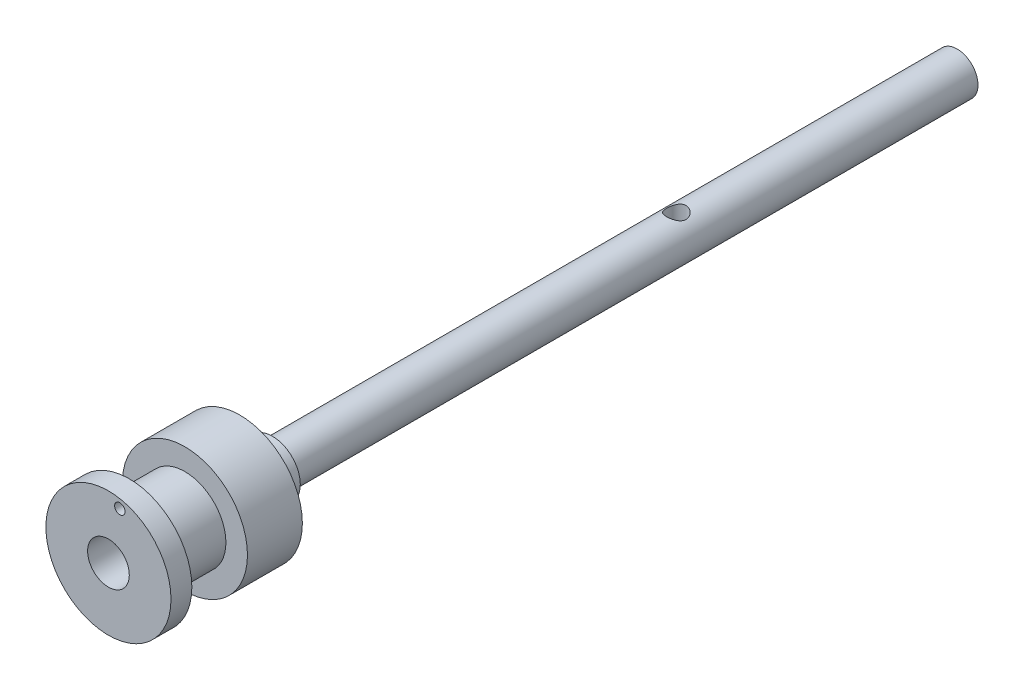
ISO-10303-21;
HEADER;
FILE_DESCRIPTION(('STEP AP214'),'2;1');
FILE_NAME('part.step','',(''),(''),'','','');
FILE_SCHEMA(('AUTOMOTIVE_DESIGN { 1 0 10303 214 1 1 1 1 }'));
ENDSEC;
DATA;
#1=APPLICATION_CONTEXT('core data for automotive mechanical design processes');
#2=APPLICATION_PROTOCOL_DEFINITION('international standard','automotive_design',2000,#1);
#3=PRODUCT_CONTEXT('',#1,'mechanical');
#4=PRODUCT('Part','Part','',(#3));
#5=PRODUCT_RELATED_PRODUCT_CATEGORY('part','',(#4));
#6=PRODUCT_DEFINITION_FORMATION('','',#4);
#7=PRODUCT_DEFINITION_CONTEXT('part definition',#1,'design');
#8=PRODUCT_DEFINITION('design','',#6,#7);
#9=PRODUCT_DEFINITION_SHAPE('','',#8);
#10=(LENGTH_UNIT() NAMED_UNIT(*) SI_UNIT(.MILLI.,.METRE.));
#11=(NAMED_UNIT(*) PLANE_ANGLE_UNIT() SI_UNIT($,.RADIAN.));
#12=(NAMED_UNIT(*) SI_UNIT($,.STERADIAN.) SOLID_ANGLE_UNIT());
#13=UNCERTAINTY_MEASURE_WITH_UNIT(LENGTH_MEASURE(1.E-05),#10,'distance_accuracy_value','');
#14=(GEOMETRIC_REPRESENTATION_CONTEXT(3) GLOBAL_UNCERTAINTY_ASSIGNED_CONTEXT((#13)) GLOBAL_UNIT_ASSIGNED_CONTEXT((#10,
#11,#12)) REPRESENTATION_CONTEXT('',''));
#15=CARTESIAN_POINT('',(0.,0.,0.));
#16=DIRECTION('',(0.,0.,1.));
#17=DIRECTION('',(1.,0.,0.));
#18=AXIS2_PLACEMENT_3D('',#15,#16,#17);
#19=CARTESIAN_POINT('',(0.,0.,98.5));
#20=DIRECTION('',(0.,0.,-1.));
#21=DIRECTION('',(-1.,0.,0.));
#22=AXIS2_PLACEMENT_3D('',#19,#20,#21);
#23=CYLINDRICAL_SURFACE('',#22,3.);
#24=CARTESIAN_POINT('',(0.,-2.99999999999999,39.));
#25=CARTESIAN_POINT('',(0.0741760141958587,-2.99999659855667,39.0000040505541));
#26=CARTESIAN_POINT('',(0.148457438343165,-2.99721866421498,39.0059298208353));
#27=CARTESIAN_POINT('',(0.294860958042646,-2.98638133101227,39.0293877592733));
#28=CARTESIAN_POINT('',(0.366977899485668,-2.97831023303417,39.046945637961));
#29=CARTESIAN_POINT('',(0.506705207958361,-2.95773878056305,39.0928517551339));
#30=CARTESIAN_POINT('',(0.574331184032734,-2.94525483671524,39.1211600432343));
#31=CARTESIAN_POINT('',(0.703790652559765,-2.91703179641225,39.1875743006987));
#32=CARTESIAN_POINT('',(0.765625113804216,-2.90129324579851,39.2256786273952));
#33=CARTESIAN_POINT('',(0.885556018232688,-2.86703510505486,39.3129906836775));
#34=CARTESIAN_POINT('',(0.943262854198603,-2.84841047078529,39.3626918392666));
#35=CARTESIAN_POINT('',(1.04987206669059,-2.81086626705385,39.4707341871541));
#36=CARTESIAN_POINT('',(1.09876864666267,-2.79194651225135,39.5290810220613));
#37=CARTESIAN_POINT('',(1.18954928643586,-2.75454886272565,39.6573436722992));
#38=CARTESIAN_POINT('',(1.23076801131512,-2.73618026181932,39.7277658265075));
#39=CARTESIAN_POINT('',(1.30060459631542,-2.70368671328043,39.8755083341662));
#40=CARTESIAN_POINT('',(1.32923050054668,-2.68955905843085,39.952824245907));
#41=CARTESIAN_POINT('',(1.37136389166293,-2.66831280778357,40.1077086691858));
#42=CARTESIAN_POINT('',(1.38562630954339,-2.66084688805231,40.185022013398));
#43=CARTESIAN_POINT('',(1.40096431780121,-2.65280653141493,40.3412761554687));
#44=CARTESIAN_POINT('',(1.40205018901381,-2.65222672171534,40.4202156363732));
#45=CARTESIAN_POINT('',(1.39156325474428,-2.6577381391041,40.5689521774073));
#46=CARTESIAN_POINT('',(1.381255487101,-2.66316277668237,40.6388686763252));
#47=CARTESIAN_POINT('',(1.35043639237287,-2.67892103840313,40.7758340783928));
#48=CARTESIAN_POINT('',(1.32992244300339,-2.68925592410991,40.8428822397673));
#49=CARTESIAN_POINT('',(1.27887161255287,-2.71390923378543,40.9740721913311));
#50=CARTESIAN_POINT('',(1.24811450695909,-2.7283140240837,41.0381113040015));
#51=CARTESIAN_POINT('',(1.17761205733664,-2.75947702819645,41.1604059963507));
#52=CARTESIAN_POINT('',(1.13786278548149,-2.77623626923161,41.2186590325906));
#53=CARTESIAN_POINT('',(1.04545769592097,-2.81242518177221,41.3343867427587));
#54=CARTESIAN_POINT('',(0.991869135627394,-2.83194722846672,41.3910901886705));
#55=CARTESIAN_POINT('',(0.875809338201011,-2.86996272516677,41.4950011611005));
#56=CARTESIAN_POINT('',(0.813334864133957,-2.88845579691006,41.5422052120085));
#57=CARTESIAN_POINT('',(0.678420066791921,-2.92314231667083,41.6273252580099));
#58=CARTESIAN_POINT('',(0.60570404390302,-2.9392303997136,41.6648505604658));
#59=CARTESIAN_POINT('',(0.454047875045114,-2.9664385628126,41.7268527185111));
#60=CARTESIAN_POINT('',(0.375112098848912,-2.97756209480586,41.7513386428982));
#61=CARTESIAN_POINT('',(0.219630179590069,-2.99289168727817,41.7847753854863));
#62=CARTESIAN_POINT('',(0.143350867486893,-2.99755511855446,41.7947561577534));
#63=CARTESIAN_POINT('',(-0.00993159603062412,-3.00096130674055,41.8020633399195));
#64=CARTESIAN_POINT('',(-0.0869344549310032,-2.99970636153703,41.7993946611306));
#65=CARTESIAN_POINT('',(-0.234138662301146,-2.99169876992405,41.7821402277437));
#66=CARTESIAN_POINT('',(-0.304455247280262,-2.98531143610107,41.768346120726));
#67=CARTESIAN_POINT('',(-0.441661374952198,-2.9681169868393,41.7304147035299));
#68=CARTESIAN_POINT('',(-0.508550515457683,-2.95730935403884,41.7062761826025));
#69=CARTESIAN_POINT('',(-0.63934631057296,-2.93186182190092,41.6476106001117));
#70=CARTESIAN_POINT('',(-0.70309874977937,-2.91711463217098,41.6127878500144));
#71=CARTESIAN_POINT('',(-0.82408133642419,-2.88527461622476,41.534065572947));
#72=CARTESIAN_POINT('',(-0.881308600637795,-2.86818076040266,41.4901620574598));
#73=CARTESIAN_POINT('',(-0.992927203863409,-2.83157928041133,41.3900494219181));
#74=CARTESIAN_POINT('',(-1.04662821994276,-2.81199150907127,41.3330982533047));
#75=CARTESIAN_POINT('',(-1.14397488618524,-2.7738171204936,41.210822052853));
#76=CARTESIAN_POINT('',(-1.18761573536873,-2.7552309844915,41.1454930459361));
#77=CARTESIAN_POINT('',(-1.26487258942864,-2.72065279755534,41.0055462612367));
#78=CARTESIAN_POINT('',(-1.29811762077689,-2.70476441122083,40.9306959670314));
#79=CARTESIAN_POINT('',(-1.35119476914698,-2.67864935946574,40.7754739377038));
#80=CARTESIAN_POINT('',(-1.37104172650418,-2.6684164320798,40.6951084206029));
#81=CARTESIAN_POINT('',(-1.39512361569358,-2.65589863089785,40.5389244522856));
#82=CARTESIAN_POINT('',(-1.40060458275625,-2.65298045006346,40.4633491392689));
#83=CARTESIAN_POINT('',(-1.39928993042138,-2.65367487263324,40.31234617673));
#84=CARTESIAN_POINT('',(-1.39249775922279,-2.65728564169682,40.2369184916911));
#85=CARTESIAN_POINT('',(-1.36795238910771,-2.66999487603889,40.0940999375163));
#86=CARTESIAN_POINT('',(-1.35103435582631,-2.67867409395688,40.0265240407042));
#87=CARTESIAN_POINT('',(-1.30765598987226,-2.70011439829818,39.8952017153972));
#88=CARTESIAN_POINT('',(-1.28119281477062,-2.71287670048705,39.8314564342173));
#89=CARTESIAN_POINT('',(-1.21748406199401,-2.74208602331761,39.7049634549476));
#90=CARTESIAN_POINT('',(-1.17964038065009,-2.75872111955289,39.6425615223786));
#91=CARTESIAN_POINT('',(-1.0949742620724,-2.79340714138716,39.5246101855588));
#92=CARTESIAN_POINT('',(-1.04814763276813,-2.81145872568486,39.4690640006461));
#93=CARTESIAN_POINT('',(-0.941307680520023,-2.84911508911861,39.3606263800043));
#94=CARTESIAN_POINT('',(-0.880442612871026,-2.86869394428718,39.3085607412822));
#95=CARTESIAN_POINT('',(-0.750199086477072,-2.90547332461736,39.2152565671488));
#96=CARTESIAN_POINT('',(-0.680816600685449,-2.92267271652822,39.1740231823952));
#97=CARTESIAN_POINT('',(-0.535611024288782,-2.95272548252542,39.1040125020167));
#98=CARTESIAN_POINT('',(-0.459824309977937,-2.96560157678301,39.0751698583364));
#99=CARTESIAN_POINT('',(-0.303822742627244,-2.98560363061671,39.0309772564507));
#100=CARTESIAN_POINT('',(-0.223621832238211,-2.99274669700571,39.0155871448256));
#101=CARTESIAN_POINT('',(-0.118989792805172,-2.99773444736987,39.0048609854243));
#102=CARTESIAN_POINT('',(-0.095239768891828,-2.99858232619917,39.0030400999808));
#103=CARTESIAN_POINT('',(-0.0476634596251001,-2.99971565466793,39.00060894435));
#104=CARTESIAN_POINT('',(-0.0238371727597248,-3.00000109308638,38.9999986983156));
#105=CARTESIAN_POINT('',(0.,-2.99999999999999,39.));
#106=B_SPLINE_CURVE_WITH_KNOTS('',3,(#24,#25,#26,#27,#28,#29,#30,#31,#32,#33,#34,#35,#36,#37,
#38,#39,#40,#41,#42,#43,#44,#45,#46,#47,#48,#49,#50,#51,#52,#53,#54,#55,#56,#57,#58,#59,#60,#61,
#62,#63,#64,#65,#66,#67,#68,#69,#70,#71,#72,#73,#74,#75,#76,#77,#78,#79,#80,#81,#82,#83,#84,#85,
#86,#87,#88,#89,#90,#91,#92,#93,#94,#95,#96,#97,#98,#99,#100,#101,#102,#103,#104,#105),
.UNSPECIFIED.,.T.,.F.,(4,2,2,2,2,2,2,2,2,2,2,2,2,2,2,2,2,2,2,2,2,2,2,2,2,2,2,2,2,2,2,2,2,2,2,2,
2,2,2,2,4),(0.,0.222430614227103,0.445354516020347,0.6674579744595,0.889524213319485,
1.12374008349084,1.35810949364731,1.60776429290694,1.85725938392491,2.09282314699249,
2.32820310256045,2.53985531348055,2.75156193252274,2.96815060600376,3.18483406988203,
3.42504393482462,3.66534152788205,3.91419776760518,4.16288070273415,4.39285884216799,
4.62274769694935,4.83758576938905,5.05244899415581,5.27389671638204,5.49544191175846,
5.73644174754949,5.97755635787824,6.2264897623231,6.47514698203737,6.70138965858241,
6.92756878101077,7.13725924988262,7.34701221368888,7.57065894835864,7.79441030722339,
8.04061569917069,8.28693794895592,8.53194466707523,8.77621756163928,8.84769634435318,
8.91917655309538),.UNSPECIFIED.);
#107=CARTESIAN_POINT('',(0.,-2.99999999999999,39.));
#108=VERTEX_POINT('',#107);
#109=EDGE_CURVE('E52',#108,#108,#106,.T.);
#110=ORIENTED_EDGE('',*,*,#109,.F.);
#111=EDGE_LOOP('',(#110));
#112=FACE_BOUND('',#111,.T.);
#113=CARTESIAN_POINT('',(0.,0.,98.5));
#114=DIRECTION('',(0.,0.,1.));
#115=DIRECTION('',(1.,0.,0.));
#116=AXIS2_PLACEMENT_3D('',#113,#114,#115);
#117=CIRCLE('',#116,3.);
#118=CARTESIAN_POINT('',(3.,0.,98.5));
#119=VERTEX_POINT('',#118);
#120=EDGE_CURVE('E10',#119,#119,#117,.T.);
#121=ORIENTED_EDGE('',*,*,#120,.F.);
#122=EDGE_LOOP('',(#121));
#123=FACE_BOUND('',#122,.T.);
#124=CARTESIAN_POINT('',(0.,0.,0.));
#125=DIRECTION('',(0.,0.,1.));
#126=DIRECTION('',(1.,0.,0.));
#127=AXIS2_PLACEMENT_3D('',#124,#125,#126);
#128=CIRCLE('',#127,3.);
#129=CARTESIAN_POINT('',(3.,0.,0.));
#130=VERTEX_POINT('',#129);
#131=EDGE_CURVE('E42',#130,#130,#128,.T.);
#132=ORIENTED_EDGE('',*,*,#131,.T.);
#133=EDGE_LOOP('',(#132));
#134=FACE_BOUND('',#133,.T.);
#135=CARTESIAN_POINT('',(0.,3.00000000000001,39.));
#136=CARTESIAN_POINT('',(-0.0741760141958469,2.99999659855672,39.0000040505541));
#137=CARTESIAN_POINT('',(-0.148457438343151,2.99721866421499,39.0059298208353));
#138=CARTESIAN_POINT('',(-0.29486095804263,2.98638133101226,39.0293877592733));
#139=CARTESIAN_POINT('',(-0.366977899485652,2.97831023303417,39.046945637961));
#140=CARTESIAN_POINT('',(-0.506705207958345,2.95773878056306,39.0928517551339));
#141=CARTESIAN_POINT('',(-0.574331184032717,2.94525483671525,39.1211600432343));
#142=CARTESIAN_POINT('',(-0.703790652559745,2.91703179641225,39.1875743006987));
#143=CARTESIAN_POINT('',(-0.765625113804196,2.90129324579851,39.2256786273952));
#144=CARTESIAN_POINT('',(-0.885556018232667,2.86703510505487,39.3129906836775));
#145=CARTESIAN_POINT('',(-0.943262854198583,2.8484104707853,39.3626918392666));
#146=CARTESIAN_POINT('',(-1.04987206669057,2.81086626705386,39.4707341871541));
#147=CARTESIAN_POINT('',(-1.09876864666265,2.79194651225135,39.5290810220613));
#148=CARTESIAN_POINT('',(-1.18954928643584,2.75454886272566,39.6573436722992));
#149=CARTESIAN_POINT('',(-1.2307680113151,2.73618026181933,39.7277658265075));
#150=CARTESIAN_POINT('',(-1.30060459631541,2.70368671328044,39.8755083341662));
#151=CARTESIAN_POINT('',(-1.32923050054667,2.68955905843086,39.952824245907));
#152=CARTESIAN_POINT('',(-1.37136389166291,2.66831280778357,40.1077086691858));
#153=CARTESIAN_POINT('',(-1.38562630954337,2.66084688805232,40.1850220133979));
#154=CARTESIAN_POINT('',(-1.4009643178012,2.65280653141493,40.3412761554687));
#155=CARTESIAN_POINT('',(-1.4020501890138,2.65222672171534,40.4202156363732));
#156=CARTESIAN_POINT('',(-1.39156325474427,2.6577381391041,40.5689521774073));
#157=CARTESIAN_POINT('',(-1.38125548710099,2.66316277668237,40.6388686763252));
#158=CARTESIAN_POINT('',(-1.35043639237286,2.67892103840314,40.7758340783928));
#159=CARTESIAN_POINT('',(-1.32992244300339,2.68925592410991,40.8428822397673));
#160=CARTESIAN_POINT('',(-1.27887161255287,2.71390923378543,40.9740721913311));
#161=CARTESIAN_POINT('',(-1.24811450695908,2.7283140240837,41.0381113040015));
#162=CARTESIAN_POINT('',(-1.17761205733663,2.75947702819645,41.1604059963507));
#163=CARTESIAN_POINT('',(-1.13786278548148,2.77623626923161,41.2186590325906));
#164=CARTESIAN_POINT('',(-1.04545769592096,2.81242518177222,41.3343867427587));
#165=CARTESIAN_POINT('',(-0.991869135627378,2.83194722846672,41.3910901886705));
#166=CARTESIAN_POINT('',(-0.875809338200995,2.86996272516678,41.4950011611005));
#167=CARTESIAN_POINT('',(-0.81333486413394,2.88845579691007,41.5422052120085));
#168=CARTESIAN_POINT('',(-0.678420066791904,2.92314231667084,41.6273252580099));
#169=CARTESIAN_POINT('',(-0.605704043903002,2.93923039971361,41.6648505604658));
#170=CARTESIAN_POINT('',(-0.454047875045098,2.9664385628126,41.7268527185111));
#171=CARTESIAN_POINT('',(-0.375112098848897,2.97756209480586,41.7513386428982));
#172=CARTESIAN_POINT('',(-0.219630179590056,2.99289168727817,41.7847753854863));
#173=CARTESIAN_POINT('',(-0.143350867486882,2.99755511855446,41.7947561577534));
#174=CARTESIAN_POINT('',(0.00993159603063146,3.00096130674055,41.8020633399195));
#175=CARTESIAN_POINT('',(0.086934454931009,2.99970636153703,41.7993946611306));
#176=CARTESIAN_POINT('',(0.234138662301149,2.99169876992405,41.7821402277437));
#177=CARTESIAN_POINT('',(0.304455247280265,2.98531143610107,41.768346120726));
#178=CARTESIAN_POINT('',(0.4416613749522,2.9681169868393,41.7304147035299));
#179=CARTESIAN_POINT('',(0.508550515457685,2.95730935403884,41.7062761826025));
#180=CARTESIAN_POINT('',(0.63934631057296,2.93186182190092,41.6476106001117));
#181=CARTESIAN_POINT('',(0.703098749779368,2.91711463217098,41.6127878500144));
#182=CARTESIAN_POINT('',(0.824081336424188,2.88527461622476,41.534065572947));
#183=CARTESIAN_POINT('',(0.881308600637792,2.86818076040266,41.4901620574598));
#184=CARTESIAN_POINT('',(0.992927203863407,2.83157928041133,41.3900494219181));
#185=CARTESIAN_POINT('',(1.04662821994276,2.81199150907127,41.3330982533047));
#186=CARTESIAN_POINT('',(1.14397488618524,2.7738171204936,41.2108220528531));
#187=CARTESIAN_POINT('',(1.18761573536872,2.7552309844915,41.1454930459362));
#188=CARTESIAN_POINT('',(1.26487258942863,2.72065279755534,41.0055462612367));
#189=CARTESIAN_POINT('',(1.29811762077689,2.70476441122083,40.9306959670314));
#190=CARTESIAN_POINT('',(1.35119476914698,2.67864935946574,40.7754739377038));
#191=CARTESIAN_POINT('',(1.37104172650419,2.6684164320798,40.695108420603));
#192=CARTESIAN_POINT('',(1.39512361569359,2.65589863089785,40.5389244522856));
#193=CARTESIAN_POINT('',(1.40060458275626,2.65298045006346,40.4633491392689));
#194=CARTESIAN_POINT('',(1.3992899304214,2.65367487263323,40.31234617673));
#195=CARTESIAN_POINT('',(1.3924977592228,2.65728564169681,40.2369184916911));
#196=CARTESIAN_POINT('',(1.36795238910772,2.66999487603889,40.0940999375163));
#197=CARTESIAN_POINT('',(1.35103435582632,2.67867409395687,40.0265240407042));
#198=CARTESIAN_POINT('',(1.30765598987227,2.70011439829818,39.8952017153972));
#199=CARTESIAN_POINT('',(1.28119281477063,2.71287670048704,39.8314564342173));
#200=CARTESIAN_POINT('',(1.21748406199402,2.7420860233176,39.7049634549476));
#201=CARTESIAN_POINT('',(1.1796403806501,2.75872111955289,39.6425615223786));
#202=CARTESIAN_POINT('',(1.09497426207241,2.79340714138716,39.5246101855588));
#203=CARTESIAN_POINT('',(1.04814763276814,2.81145872568485,39.4690640006461));
#204=CARTESIAN_POINT('',(0.941307680520036,2.8491150891186,39.3606263800043));
#205=CARTESIAN_POINT('',(0.880442612871037,2.86869394428718,39.3085607412822));
#206=CARTESIAN_POINT('',(0.750199086477081,2.90547332461736,39.2152565671488));
#207=CARTESIAN_POINT('',(0.680816600685458,2.92267271652822,39.1740231823952));
#208=CARTESIAN_POINT('',(0.53561102428879,2.95272548252542,39.1040125020167));
#209=CARTESIAN_POINT('',(0.459824309977945,2.965601576783,39.0751698583364));
#210=CARTESIAN_POINT('',(0.303822742627252,2.98560363061672,39.0309772564507));
#211=CARTESIAN_POINT('',(0.223621832238217,2.99274669700571,39.0155871448256));
#212=CARTESIAN_POINT('',(0.118989792805178,2.99773444736986,39.0048609854243));
#213=CARTESIAN_POINT('',(0.0952397688918347,2.99858232619917,39.0030400999808));
#214=CARTESIAN_POINT('',(0.0476634596251082,2.99971565466794,39.00060894435));
#215=CARTESIAN_POINT('',(0.0238371727597338,3.0000010930864,38.9999986983156));
#216=CARTESIAN_POINT('',(0.,3.00000000000001,39.));
#217=B_SPLINE_CURVE_WITH_KNOTS('',3,(#135,#136,#137,#138,#139,#140,#141,#142,#143,#144,#145,
#146,#147,#148,#149,#150,#151,#152,#153,#154,#155,#156,#157,#158,#159,#160,#161,#162,#163,#164,
#165,#166,#167,#168,#169,#170,#171,#172,#173,#174,#175,#176,#177,#178,#179,#180,#181,#182,#183,
#184,#185,#186,#187,#188,#189,#190,#191,#192,#193,#194,#195,#196,#197,#198,#199,#200,#201,#202,
#203,#204,#205,#206,#207,#208,#209,#210,#211,#212,#213,#214,#215,#216),.UNSPECIFIED.,.T.,.F.,(4,
2,2,2,2,2,2,2,2,2,2,2,2,2,2,2,2,2,2,2,2,2,2,2,2,2,2,2,2,2,2,2,2,2,2,2,2,2,2,2,4),(0.,
0.222430614227098,0.44535451602034,0.66745797445949,0.889524213319474,1.12374008349083,
1.35810949364729,1.60776429290693,1.85725938392489,2.09282314699247,2.32820310256043,
2.53985531348055,2.75156193252273,2.96815060600376,3.18483406988204,3.42504393482462,
3.66534152788206,3.91419776760519,4.16288070273415,4.39285884216799,4.62274769694934,
4.83758576938904,5.0524489941558,5.27389671638202,5.49544191175844,5.73644174754946,
5.97755635787822,6.22648976232308,6.47514698203736,6.70138965858239,6.92756878101076,
7.13725924988262,7.34701221368887,7.57065894835864,7.79441030722338,8.04061569917069,
8.28693794895592,8.53194466707523,8.77621756163929,8.84769634435318,8.91917655309538),.UNSPECIFIED.);
#218=CARTESIAN_POINT('',(0.,3.00000000000001,39.));
#219=VERTEX_POINT('',#218);
#220=EDGE_CURVE('E35',#219,#219,#217,.T.);
#221=ORIENTED_EDGE('',*,*,#220,.F.);
#222=EDGE_LOOP('',(#221));
#223=FACE_BOUND('',#222,.T.);
#224=ADVANCED_FACE('F31',(#112,#123,#134,#223),#23,.T.);
#225=CARTESIAN_POINT('',(0.,0.,111.1));
#226=DIRECTION('',(0.,0.,1.));
#227=DIRECTION('',(1.,0.,0.));
#228=AXIS2_PLACEMENT_3D('',#225,#226,#227);
#229=PLANE('',#228);
#230=CARTESIAN_POINT('',(0.,0.,111.1));
#231=DIRECTION('',(0.,0.,1.));
#232=DIRECTION('',(1.,0.,0.));
#233=AXIS2_PLACEMENT_3D('',#230,#231,#232);
#234=CIRCLE('',#233,9.);
#235=CARTESIAN_POINT('',(9.,0.,111.1));
#236=VERTEX_POINT('',#235);
#237=EDGE_CURVE('E135',#236,#236,#234,.T.);
#238=ORIENTED_EDGE('',*,*,#237,.T.);
#239=EDGE_LOOP('',(#238));
#240=FACE_BOUND('',#239,.T.);
#241=CARTESIAN_POINT('',(0.,0.,111.1));
#242=DIRECTION('',(0.,0.,1.));
#243=DIRECTION('',(1.,0.,0.));
#244=AXIS2_PLACEMENT_3D('',#241,#242,#243);
#245=CIRCLE('',#244,5.9);
#246=CARTESIAN_POINT('',(5.9,0.,111.1));
#247=VERTEX_POINT('',#246);
#248=EDGE_CURVE('E125',#247,#247,#245,.T.);
#249=ORIENTED_EDGE('',*,*,#248,.F.);
#250=EDGE_LOOP('',(#249));
#251=FACE_BOUND('',#250,.T.);
#252=ADVANCED_FACE('F83',(#240,#251),#229,.T.);
#253=CARTESIAN_POINT('',(0.,0.,0.));
#254=DIRECTION('',(0.,0.,1.));
#255=DIRECTION('',(1.,0.,0.));
#256=AXIS2_PLACEMENT_3D('',#253,#254,#255);
#257=PLANE('',#256);
#258=ORIENTED_EDGE('',*,*,#131,.F.);
#259=EDGE_LOOP('',(#258));
#260=FACE_BOUND('',#259,.T.);
#261=ADVANCED_FACE('F86',(#260),#257,.F.);
#262=CARTESIAN_POINT('',(0.,0.,98.5));
#263=DIRECTION('',(0.,0.,1.));
#264=DIRECTION('',(1.,0.,0.));
#265=AXIS2_PLACEMENT_3D('',#262,#263,#264);
#266=PLANE('',#265);
#267=CARTESIAN_POINT('',(0.,0.,98.5));
#268=DIRECTION('',(0.,0.,1.));
#269=DIRECTION('',(1.,0.,0.));
#270=AXIS2_PLACEMENT_3D('',#267,#268,#269);
#271=CIRCLE('',#270,4.);
#272=CARTESIAN_POINT('',(4.,0.,98.5));
#273=VERTEX_POINT('',#272);
#274=EDGE_CURVE('E50',#273,#273,#271,.T.);
#275=ORIENTED_EDGE('',*,*,#274,.F.);
#276=EDGE_LOOP('',(#275));
#277=FACE_BOUND('',#276,.T.);
#278=ORIENTED_EDGE('',*,*,#120,.T.);
#279=EDGE_LOOP('',(#278));
#280=FACE_BOUND('',#279,.T.);
#281=ADVANCED_FACE('F96',(#277,#280),#266,.F.);
#282=CARTESIAN_POINT('',(0.,0.,103.2));
#283=DIRECTION('',(0.,0.,-1.));
#284=DIRECTION('',(-1.,0.,0.));
#285=AXIS2_PLACEMENT_3D('',#282,#283,#284);
#286=CYLINDRICAL_SURFACE('',#285,4.);
#287=CARTESIAN_POINT('',(0.,0.,103.2));
#288=DIRECTION('',(0.,0.,1.));
#289=DIRECTION('',(1.,0.,0.));
#290=AXIS2_PLACEMENT_3D('',#287,#288,#289);
#291=CIRCLE('',#290,4.);
#292=CARTESIAN_POINT('',(4.,0.,103.2));
#293=VERTEX_POINT('',#292);
#294=EDGE_CURVE('E47',#293,#293,#291,.T.);
#295=ORIENTED_EDGE('',*,*,#294,.F.);
#296=EDGE_LOOP('',(#295));
#297=FACE_BOUND('',#296,.T.);
#298=ORIENTED_EDGE('',*,*,#274,.T.);
#299=EDGE_LOOP('',(#298));
#300=FACE_BOUND('',#299,.T.);
#301=ADVANCED_FACE('F91',(#297,#300),#286,.T.);
#302=CARTESIAN_POINT('',(0.,0.,103.2));
#303=DIRECTION('',(0.,0.,1.));
#304=DIRECTION('',(1.,0.,0.));
#305=AXIS2_PLACEMENT_3D('',#302,#303,#304);
#306=PLANE('',#305);
#307=CARTESIAN_POINT('',(0.,0.,103.2));
#308=DIRECTION('',(0.,0.,1.));
#309=DIRECTION('',(1.,0.,0.));
#310=AXIS2_PLACEMENT_3D('',#307,#308,#309);
#311=CIRCLE('',#310,9.);
#312=CARTESIAN_POINT('',(9.,0.,103.2));
#313=VERTEX_POINT('',#312);
#314=EDGE_CURVE('E132',#313,#313,#311,.T.);
#315=ORIENTED_EDGE('',*,*,#314,.F.);
#316=EDGE_LOOP('',(#315));
#317=FACE_BOUND('',#316,.T.);
#318=ORIENTED_EDGE('',*,*,#294,.T.);
#319=EDGE_LOOP('',(#318));
#320=FACE_BOUND('',#319,.T.);
#321=ADVANCED_FACE('F88',(#317,#320),#306,.F.);
#322=CARTESIAN_POINT('',(0.,0.,111.1));
#323=DIRECTION('',(0.,0.,-1.));
#324=DIRECTION('',(-1.,0.,0.));
#325=AXIS2_PLACEMENT_3D('',#322,#323,#324);
#326=CYLINDRICAL_SURFACE('',#325,9.);
#327=ORIENTED_EDGE('',*,*,#237,.F.);
#328=EDGE_LOOP('',(#327));
#329=FACE_BOUND('',#328,.T.);
#330=ORIENTED_EDGE('',*,*,#314,.T.);
#331=EDGE_LOOP('',(#330));
#332=FACE_BOUND('',#331,.T.);
#333=ADVANCED_FACE('F81',(#329,#332),#326,.T.);
#334=CARTESIAN_POINT('',(0.,0.,119.1));
#335=DIRECTION('',(0.,0.,-1.));
#336=DIRECTION('',(-1.,0.,0.));
#337=AXIS2_PLACEMENT_3D('',#334,#335,#336);
#338=CYLINDRICAL_SURFACE('',#337,5.9);
#339=CARTESIAN_POINT('',(0.,0.,119.1));
#340=DIRECTION('',(0.,0.,1.));
#341=DIRECTION('',(1.,0.,0.));
#342=AXIS2_PLACEMENT_3D('',#339,#340,#341);
#343=CIRCLE('',#342,5.9);
#344=CARTESIAN_POINT('',(5.9,0.,119.1));
#345=VERTEX_POINT('',#344);
#346=EDGE_CURVE('E129',#345,#345,#343,.T.);
#347=ORIENTED_EDGE('',*,*,#346,.F.);
#348=EDGE_LOOP('',(#347));
#349=FACE_BOUND('',#348,.T.);
#350=ORIENTED_EDGE('',*,*,#248,.T.);
#351=EDGE_LOOP('',(#350));
#352=FACE_BOUND('',#351,.T.);
#353=ADVANCED_FACE('F74',(#349,#352),#338,.T.);
#354=CARTESIAN_POINT('',(0.,0.,119.1));
#355=DIRECTION('',(0.,0.,1.));
#356=DIRECTION('',(1.,0.,0.));
#357=AXIS2_PLACEMENT_3D('',#354,#355,#356);
#358=PLANE('',#357);
#359=CARTESIAN_POINT('',(1.63775133757756,7.5882478641098,119.1));
#360=DIRECTION('',(0.,0.,1.));
#361=DIRECTION('',(1.,0.,0.));
#362=AXIS2_PLACEMENT_3D('',#359,#360,#361);
#363=CIRCLE('',#362,0.75);
#364=CARTESIAN_POINT('',(2.38775133757756,7.5882478641098,119.1));
#365=VERTEX_POINT('',#364);
#366=EDGE_CURVE('E156',#365,#365,#363,.T.);
#367=ORIENTED_EDGE('',*,*,#366,.T.);
#368=EDGE_LOOP('',(#367));
#369=FACE_BOUND('',#368,.T.);
#370=CARTESIAN_POINT('',(0.,0.,119.1));
#371=DIRECTION('',(0.,0.,1.));
#372=DIRECTION('',(1.,0.,0.));
#373=AXIS2_PLACEMENT_3D('',#370,#371,#372);
#374=CIRCLE('',#373,9.);
#375=CARTESIAN_POINT('',(9.,0.,119.1));
#376=VERTEX_POINT('',#375);
#377=EDGE_CURVE('E118',#376,#376,#374,.T.);
#378=ORIENTED_EDGE('',*,*,#377,.F.);
#379=EDGE_LOOP('',(#378));
#380=FACE_BOUND('',#379,.T.);
#381=ORIENTED_EDGE('',*,*,#346,.T.);
#382=EDGE_LOOP('',(#381));
#383=FACE_BOUND('',#382,.T.);
#384=ADVANCED_FACE('F71',(#369,#380,#383),#358,.F.);
#385=CARTESIAN_POINT('',(0.,0.,122.1));
#386=DIRECTION('',(0.,0.,-1.));
#387=DIRECTION('',(-1.,0.,0.));
#388=AXIS2_PLACEMENT_3D('',#385,#386,#387);
#389=CYLINDRICAL_SURFACE('',#388,9.);
#390=CARTESIAN_POINT('',(0.,0.,122.1));
#391=DIRECTION('',(0.,0.,1.));
#392=DIRECTION('',(1.,0.,0.));
#393=AXIS2_PLACEMENT_3D('',#390,#391,#392);
#394=CIRCLE('',#393,9.);
#395=CARTESIAN_POINT('',(9.,0.,122.1));
#396=VERTEX_POINT('',#395);
#397=EDGE_CURVE('E120',#396,#396,#394,.T.);
#398=ORIENTED_EDGE('',*,*,#397,.F.);
#399=EDGE_LOOP('',(#398));
#400=FACE_BOUND('',#399,.T.);
#401=ORIENTED_EDGE('',*,*,#377,.T.);
#402=EDGE_LOOP('',(#401));
#403=FACE_BOUND('',#402,.T.);
#404=ADVANCED_FACE('F69',(#400,#403),#389,.T.);
#405=CARTESIAN_POINT('',(0.,0.,122.1));
#406=DIRECTION('',(0.,0.,1.));
#407=DIRECTION('',(1.,0.,0.));
#408=AXIS2_PLACEMENT_3D('',#405,#406,#407);
#409=PLANE('',#408);
#410=CARTESIAN_POINT('',(1.63775133757756,7.5882478641098,122.1));
#411=DIRECTION('',(0.,0.,1.));
#412=DIRECTION('',(1.,0.,0.));
#413=AXIS2_PLACEMENT_3D('',#410,#411,#412);
#414=CIRCLE('',#413,0.75);
#415=CARTESIAN_POINT('',(2.38775133757756,7.5882478641098,122.1));
#416=VERTEX_POINT('',#415);
#417=EDGE_CURVE('E161',#416,#416,#414,.T.);
#418=ORIENTED_EDGE('',*,*,#417,.F.);
#419=EDGE_LOOP('',(#418));
#420=FACE_BOUND('',#419,.T.);
#421=CARTESIAN_POINT('',(0.,0.,122.1));
#422=DIRECTION('',(0.,0.,1.));
#423=DIRECTION('',(1.,0.,0.));
#424=AXIS2_PLACEMENT_3D('',#421,#422,#423);
#425=CIRCLE('',#424,3.);
#426=CARTESIAN_POINT('',(3.,0.,122.1));
#427=VERTEX_POINT('',#426);
#428=EDGE_CURVE('E153',#427,#427,#425,.T.);
#429=ORIENTED_EDGE('',*,*,#428,.F.);
#430=EDGE_LOOP('',(#429));
#431=FACE_BOUND('',#430,.T.);
#432=ORIENTED_EDGE('',*,*,#397,.T.);
#433=EDGE_LOOP('',(#432));
#434=FACE_BOUND('',#433,.T.);
#435=ADVANCED_FACE('F63',(#420,#431,#434),#409,.T.);
#436=CARTESIAN_POINT('',(0.,82.,40.4));
#437=DIRECTION('',(0.,-1.,0.));
#438=DIRECTION('',(0.,0.,-1.));
#439=AXIS2_PLACEMENT_3D('',#436,#437,#438);
#440=CYLINDRICAL_SURFACE('',#439,1.4);
#441=ORIENTED_EDGE('',*,*,#109,.T.);
#442=EDGE_LOOP('',(#441));
#443=FACE_BOUND('',#442,.T.);
#444=ORIENTED_EDGE('',*,*,#220,.T.);
#445=EDGE_LOOP('',(#444));
#446=FACE_BOUND('',#445,.T.);
#447=ADVANCED_FACE('F57',(#443,#446),#440,.F.);
#448=CARTESIAN_POINT('',(0.,0.,113.1));
#449=DIRECTION('',(0.,0.,1.));
#450=DIRECTION('',(1.,0.,0.));
#451=AXIS2_PLACEMENT_3D('',#448,#449,#450);
#452=CYLINDRICAL_SURFACE('',#451,3.);
#453=CARTESIAN_POINT('',(0.,0.,113.1));
#454=DIRECTION('',(0.,0.,1.));
#455=DIRECTION('',(1.,0.,0.));
#456=AXIS2_PLACEMENT_3D('',#453,#454,#455);
#457=CIRCLE('',#456,3.);
#458=CARTESIAN_POINT('',(3.,0.,113.1));
#459=VERTEX_POINT('',#458);
#460=EDGE_CURVE('E56',#459,#459,#457,.T.);
#461=ORIENTED_EDGE('',*,*,#460,.F.);
#462=EDGE_LOOP('',(#461));
#463=FACE_BOUND('',#462,.T.);
#464=ORIENTED_EDGE('',*,*,#428,.T.);
#465=EDGE_LOOP('',(#464));
#466=FACE_BOUND('',#465,.T.);
#467=ADVANCED_FACE('F62',(#463,#466),#452,.F.);
#468=CARTESIAN_POINT('',(0.,0.,113.1));
#469=DIRECTION('',(0.,0.,1.));
#470=DIRECTION('',(1.,0.,0.));
#471=AXIS2_PLACEMENT_3D('',#468,#469,#470);
#472=PLANE('',#471);
#473=ORIENTED_EDGE('',*,*,#460,.T.);
#474=EDGE_LOOP('',(#473));
#475=FACE_BOUND('',#474,.T.);
#476=ADVANCED_FACE('F173',(#475),#472,.T.);
#477=CARTESIAN_POINT('',(1.63775133757756,7.5882478641098,113.1));
#478=DIRECTION('',(0.,0.,1.));
#479=DIRECTION('',(1.,0.,0.));
#480=AXIS2_PLACEMENT_3D('',#477,#478,#479);
#481=CYLINDRICAL_SURFACE('',#480,0.75);
#482=ORIENTED_EDGE('',*,*,#417,.T.);
#483=EDGE_LOOP('',(#482));
#484=FACE_BOUND('',#483,.T.);
#485=ORIENTED_EDGE('',*,*,#366,.F.);
#486=EDGE_LOOP('',(#485));
#487=FACE_BOUND('',#486,.T.);
#488=ADVANCED_FACE('F165',(#484,#487),#481,.F.);
#489=CLOSED_SHELL('',(#224,#252,#261,#281,#301,#321,#333,#353,#384,#404,#435,#447,#467,#476,#488));
#490=MANIFOLD_SOLID_BREP('B2',#489);
#491=ADVANCED_BREP_SHAPE_REPRESENTATION('',(#18,#490),#14);
#492=SHAPE_DEFINITION_REPRESENTATION(#9,#491);
ENDSEC;
END-ISO-10303-21;
